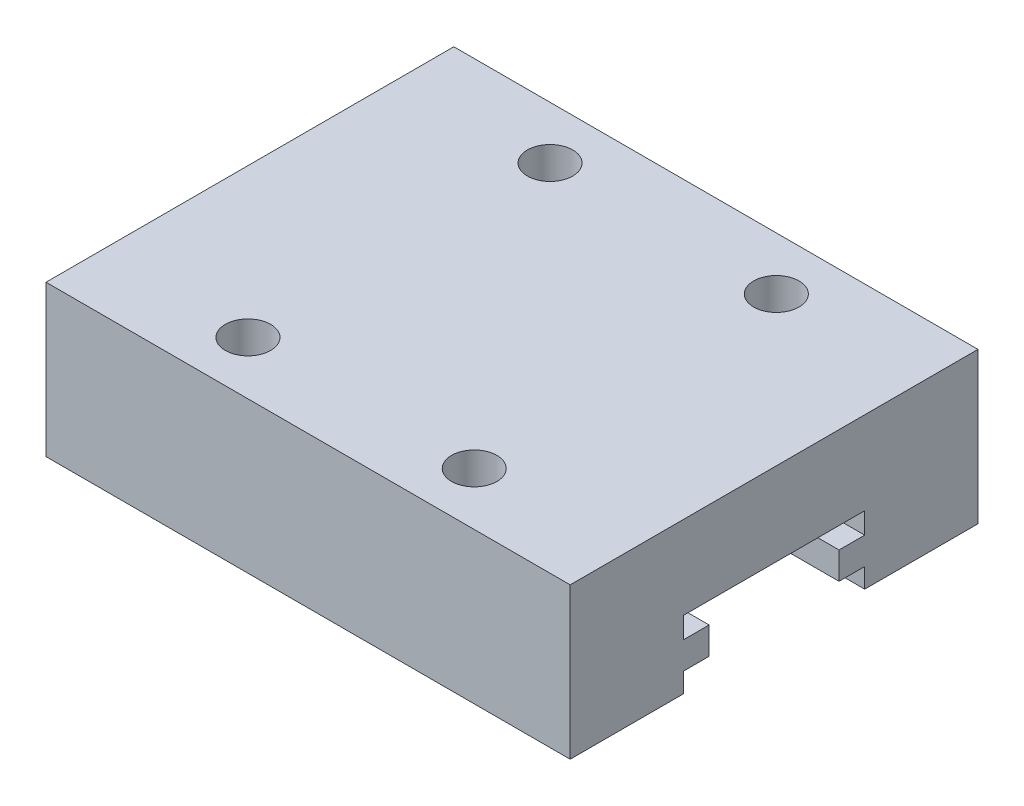
ISO-10303-21;
HEADER;
FILE_DESCRIPTION(('STEP AP214'),'2;1');
FILE_NAME('part.step','',(''),(''),'','','');
FILE_SCHEMA(('AUTOMOTIVE_DESIGN { 1 0 10303 214 1 1 1 1 }'));
ENDSEC;
DATA;
#1=APPLICATION_CONTEXT('core data for automotive mechanical design processes');
#2=APPLICATION_PROTOCOL_DEFINITION('international standard','automotive_design',2000,#1);
#3=PRODUCT_CONTEXT('',#1,'mechanical');
#4=PRODUCT('Part','Part','',(#3));
#5=PRODUCT_RELATED_PRODUCT_CATEGORY('part','',(#4));
#6=PRODUCT_DEFINITION_FORMATION('','',#4);
#7=PRODUCT_DEFINITION_CONTEXT('part definition',#1,'design');
#8=PRODUCT_DEFINITION('design','',#6,#7);
#9=PRODUCT_DEFINITION_SHAPE('','',#8);
#10=(LENGTH_UNIT() NAMED_UNIT(*) SI_UNIT(.MILLI.,.METRE.));
#11=(NAMED_UNIT(*) PLANE_ANGLE_UNIT() SI_UNIT($,.RADIAN.));
#12=(NAMED_UNIT(*) SI_UNIT($,.STERADIAN.) SOLID_ANGLE_UNIT());
#13=UNCERTAINTY_MEASURE_WITH_UNIT(LENGTH_MEASURE(1.E-05),#10,'distance_accuracy_value','');
#14=(GEOMETRIC_REPRESENTATION_CONTEXT(3) GLOBAL_UNCERTAINTY_ASSIGNED_CONTEXT((#13)) GLOBAL_UNIT_ASSIGNED_CONTEXT((#10,
#11,#12)) REPRESENTATION_CONTEXT('',''));
#15=CARTESIAN_POINT('',(0.,0.,0.));
#16=DIRECTION('',(0.,0.,1.));
#17=DIRECTION('',(1.,0.,0.));
#18=AXIS2_PLACEMENT_3D('',#15,#16,#17);
#19=CARTESIAN_POINT('',(0.,0.,0.));
#20=DIRECTION('',(0.,-1.,0.));
#21=DIRECTION('',(0.,0.,-1.));
#22=AXIS2_PLACEMENT_3D('',#19,#20,#21);
#23=PLANE('',#22);
#24=DIRECTION('',(1.,0.,0.));
#25=VECTOR('',#24,1.);
#26=CARTESIAN_POINT('',(-12.8160056179763,0.,-7.5));
#27=LINE('',#26,#25);
#28=CARTESIAN_POINT('',(0.,0.,-7.5));
#29=VERTEX_POINT('',#28);
#30=CARTESIAN_POINT('',(34.7,0.,-7.5));
#31=VERTEX_POINT('',#30);
#32=EDGE_CURVE('E162',#29,#31,#27,.T.);
#33=ORIENTED_EDGE('',*,*,#32,.T.);
#34=DIRECTION('',(0.,0.,-1.));
#35=VECTOR('',#34,1.);
#36=CARTESIAN_POINT('',(34.7,0.,0.));
#37=LINE('',#36,#35);
#38=CARTESIAN_POINT('',(34.7,0.,0.));
#39=VERTEX_POINT('',#38);
#40=EDGE_CURVE('E176',#39,#31,#37,.T.);
#41=ORIENTED_EDGE('',*,*,#40,.F.);
#42=DIRECTION('',(1.,0.,0.));
#43=VECTOR('',#42,1.);
#44=CARTESIAN_POINT('',(0.,0.,0.));
#45=LINE('',#44,#43);
#46=CARTESIAN_POINT('',(0.,0.,0.));
#47=VERTEX_POINT('',#46);
#48=EDGE_CURVE('E188',#47,#39,#45,.T.);
#49=ORIENTED_EDGE('',*,*,#48,.F.);
#50=DIRECTION('',(0.,0.,1.));
#51=VECTOR('',#50,1.);
#52=CARTESIAN_POINT('',(0.,0.,0.));
#53=LINE('',#52,#51);
#54=EDGE_CURVE('E177',#29,#47,#53,.T.);
#55=ORIENTED_EDGE('',*,*,#54,.F.);
#56=EDGE_LOOP('',(#33,#41,#49,#55));
#57=FACE_BOUND('',#56,.T.);
#58=ADVANCED_FACE('F37',(#57),#23,.T.);
#59=CARTESIAN_POINT('',(0.,10.,0.));
#60=DIRECTION('',(1.,0.,0.));
#61=DIRECTION('',(0.,0.,-1.));
#62=AXIS2_PLACEMENT_3D('',#59,#60,#61);
#63=PLANE('',#62);
#64=DIRECTION('',(0.,0.,-1.));
#65=VECTOR('',#64,1.);
#66=CARTESIAN_POINT('',(0.,1.3,-7.5));
#67=LINE('',#66,#65);
#68=CARTESIAN_POINT('',(0.,1.3,-7.5));
#69=VERTEX_POINT('',#68);
#70=CARTESIAN_POINT('',(0.,1.3,-9.2));
#71=VERTEX_POINT('',#70);
#72=EDGE_CURVE('E284',#69,#71,#67,.T.);
#73=ORIENTED_EDGE('',*,*,#72,.F.);
#74=DIRECTION('',(0.,1.,0.));
#75=VECTOR('',#74,1.);
#76=CARTESIAN_POINT('',(0.,0.,-7.5));
#77=LINE('',#76,#75);
#78=EDGE_CURVE('E233',#29,#69,#77,.T.);
#79=ORIENTED_EDGE('',*,*,#78,.F.);
#80=ORIENTED_EDGE('',*,*,#54,.T.);
#81=DIRECTION('',(0.,-1.,0.));
#82=VECTOR('',#81,1.);
#83=CARTESIAN_POINT('',(0.,10.,0.));
#84=LINE('',#83,#82);
#85=CARTESIAN_POINT('',(0.,10.,0.));
#86=VERTEX_POINT('',#85);
#87=EDGE_CURVE('E11',#86,#47,#84,.T.);
#88=ORIENTED_EDGE('',*,*,#87,.F.);
#89=DIRECTION('',(0.,0.,1.));
#90=VECTOR('',#89,1.);
#91=CARTESIAN_POINT('',(0.,10.,0.));
#92=LINE('',#91,#90);
#93=CARTESIAN_POINT('',(0.,10.,-27.));
#94=VERTEX_POINT('',#93);
#95=EDGE_CURVE('E186',#94,#86,#92,.T.);
#96=ORIENTED_EDGE('',*,*,#95,.F.);
#97=DIRECTION('',(0.,-1.,0.));
#98=VECTOR('',#97,1.);
#99=CARTESIAN_POINT('',(0.,10.,-27.));
#100=LINE('',#99,#98);
#101=CARTESIAN_POINT('',(0.,0.,-27.));
#102=VERTEX_POINT('',#101);
#103=EDGE_CURVE('E192',#94,#102,#100,.T.);
#104=ORIENTED_EDGE('',*,*,#103,.T.);
#105=CARTESIAN_POINT('',(0.,0.,-19.5));
#106=VERTEX_POINT('',#105);
#107=EDGE_CURVE('E202',#102,#106,#53,.T.);
#108=ORIENTED_EDGE('',*,*,#107,.T.);
#109=DIRECTION('',(0.,-1.,0.));
#110=VECTOR('',#109,1.);
#111=CARTESIAN_POINT('',(0.,0.,-19.5));
#112=LINE('',#111,#110);
#113=CARTESIAN_POINT('',(0.,1.3,-19.5));
#114=VERTEX_POINT('',#113);
#115=EDGE_CURVE('E52',#114,#106,#112,.T.);
#116=ORIENTED_EDGE('',*,*,#115,.F.);
#117=DIRECTION('',(0.,0.,-1.));
#118=VECTOR('',#117,1.);
#119=CARTESIAN_POINT('',(0.,1.3,-19.5));
#120=LINE('',#119,#118);
#121=CARTESIAN_POINT('',(0.,1.3,-17.8));
#122=VERTEX_POINT('',#121);
#123=EDGE_CURVE('E300',#122,#114,#120,.T.);
#124=ORIENTED_EDGE('',*,*,#123,.F.);
#125=DIRECTION('',(0.,-1.,0.));
#126=VECTOR('',#125,1.);
#127=CARTESIAN_POINT('',(0.,3.1,-17.8));
#128=LINE('',#127,#126);
#129=CARTESIAN_POINT('',(0.,3.1,-17.8));
#130=VERTEX_POINT('',#129);
#131=EDGE_CURVE('E298',#130,#122,#128,.T.);
#132=ORIENTED_EDGE('',*,*,#131,.F.);
#133=DIRECTION('',(0.,0.,1.));
#134=VECTOR('',#133,1.);
#135=CARTESIAN_POINT('',(0.,3.1,-19.5));
#136=LINE('',#135,#134);
#137=CARTESIAN_POINT('',(0.,3.1,-19.5));
#138=VERTEX_POINT('',#137);
#139=EDGE_CURVE('E296',#138,#130,#136,.T.);
#140=ORIENTED_EDGE('',*,*,#139,.F.);
#141=DIRECTION('',(0.,-1.,0.));
#142=VECTOR('',#141,1.);
#143=CARTESIAN_POINT('',(0.,3.1,-19.5));
#144=LINE('',#143,#142);
#145=CARTESIAN_POINT('',(0.,4.5,-19.5));
#146=VERTEX_POINT('',#145);
#147=EDGE_CURVE('E294',#146,#138,#144,.T.);
#148=ORIENTED_EDGE('',*,*,#147,.F.);
#149=DIRECTION('',(0.,0.,-1.));
#150=VECTOR('',#149,1.);
#151=CARTESIAN_POINT('',(0.,4.5,-7.5));
#152=LINE('',#151,#150);
#153=CARTESIAN_POINT('',(0.,4.5,-7.5));
#154=VERTEX_POINT('',#153);
#155=EDGE_CURVE('E292',#154,#146,#152,.T.);
#156=ORIENTED_EDGE('',*,*,#155,.F.);
#157=DIRECTION('',(0.,1.,0.));
#158=VECTOR('',#157,1.);
#159=CARTESIAN_POINT('',(0.,3.1,-7.5));
#160=LINE('',#159,#158);
#161=CARTESIAN_POINT('',(0.,3.1,-7.5));
#162=VERTEX_POINT('',#161);
#163=EDGE_CURVE('E290',#162,#154,#160,.T.);
#164=ORIENTED_EDGE('',*,*,#163,.F.);
#165=DIRECTION('',(0.,0.,1.));
#166=VECTOR('',#165,1.);
#167=CARTESIAN_POINT('',(0.,3.1,-7.5));
#168=LINE('',#167,#166);
#169=CARTESIAN_POINT('',(0.,3.1,-9.2));
#170=VERTEX_POINT('',#169);
#171=EDGE_CURVE('E288',#170,#162,#168,.T.);
#172=ORIENTED_EDGE('',*,*,#171,.F.);
#173=DIRECTION('',(0.,1.,0.));
#174=VECTOR('',#173,1.);
#175=CARTESIAN_POINT('',(0.,3.1,-9.2));
#176=LINE('',#175,#174);
#177=EDGE_CURVE('E286',#71,#170,#176,.T.);
#178=ORIENTED_EDGE('',*,*,#177,.F.);
#179=EDGE_LOOP('',(#73,#79,#80,#88,#96,#104,#108,#116,#124,#132,#140,#148,#156,#164,#172,#178));
#180=FACE_BOUND('',#179,.T.);
#181=ADVANCED_FACE('F39',(#180),#63,.F.);
#182=CARTESIAN_POINT('',(0.,10.,0.));
#183=DIRECTION('',(0.,0.,-1.));
#184=DIRECTION('',(-1.,0.,0.));
#185=AXIS2_PLACEMENT_3D('',#182,#183,#184);
#186=PLANE('',#185);
#187=ORIENTED_EDGE('',*,*,#48,.T.);
#188=DIRECTION('',(0.,-1.,0.));
#189=VECTOR('',#188,1.);
#190=CARTESIAN_POINT('',(34.7,10.,0.));
#191=LINE('',#190,#189);
#192=CARTESIAN_POINT('',(34.7,10.,0.));
#193=VERTEX_POINT('',#192);
#194=EDGE_CURVE('E45',#193,#39,#191,.T.);
#195=ORIENTED_EDGE('',*,*,#194,.F.);
#196=DIRECTION('',(1.,0.,0.));
#197=VECTOR('',#196,1.);
#198=CARTESIAN_POINT('',(0.,10.,0.));
#199=LINE('',#198,#197);
#200=EDGE_CURVE('E89',#86,#193,#199,.T.);
#201=ORIENTED_EDGE('',*,*,#200,.F.);
#202=ORIENTED_EDGE('',*,*,#87,.T.);
#203=EDGE_LOOP('',(#187,#195,#201,#202));
#204=FACE_BOUND('',#203,.T.);
#205=ADVANCED_FACE('F313',(#204),#186,.F.);
#206=CARTESIAN_POINT('',(34.7,10.,0.));
#207=DIRECTION('',(-1.,0.,0.));
#208=DIRECTION('',(0.,0.,1.));
#209=AXIS2_PLACEMENT_3D('',#206,#207,#208);
#210=PLANE('',#209);
#211=ORIENTED_EDGE('',*,*,#40,.T.);
#212=DIRECTION('',(0.,-1.,0.));
#213=VECTOR('',#212,1.);
#214=CARTESIAN_POINT('',(34.7,0.,-7.5));
#215=LINE('',#214,#213);
#216=CARTESIAN_POINT('',(34.7,1.3,-7.5));
#217=VERTEX_POINT('',#216);
#218=EDGE_CURVE('E159',#217,#31,#215,.T.);
#219=ORIENTED_EDGE('',*,*,#218,.F.);
#220=DIRECTION('',(0.,0.,1.));
#221=VECTOR('',#220,1.);
#222=CARTESIAN_POINT('',(34.7,1.3,-7.5));
#223=LINE('',#222,#221);
#224=CARTESIAN_POINT('',(34.7,1.3,-9.2));
#225=VERTEX_POINT('',#224);
#226=EDGE_CURVE('E179',#225,#217,#223,.T.);
#227=ORIENTED_EDGE('',*,*,#226,.F.);
#228=DIRECTION('',(0.,-1.,0.));
#229=VECTOR('',#228,1.);
#230=CARTESIAN_POINT('',(34.7,3.1,-9.2));
#231=LINE('',#230,#229);
#232=CARTESIAN_POINT('',(34.7,3.1,-9.2));
#233=VERTEX_POINT('',#232);
#234=EDGE_CURVE('E257',#233,#225,#231,.T.);
#235=ORIENTED_EDGE('',*,*,#234,.F.);
#236=DIRECTION('',(0.,0.,-1.));
#237=VECTOR('',#236,1.);
#238=CARTESIAN_POINT('',(34.7,3.1,-7.5));
#239=LINE('',#238,#237);
#240=CARTESIAN_POINT('',(34.7,3.1,-7.5));
#241=VERTEX_POINT('',#240);
#242=EDGE_CURVE('E260',#241,#233,#239,.T.);
#243=ORIENTED_EDGE('',*,*,#242,.F.);
#244=DIRECTION('',(0.,-1.,0.));
#245=VECTOR('',#244,1.);
#246=CARTESIAN_POINT('',(34.7,3.1,-7.5));
#247=LINE('',#246,#245);
#248=CARTESIAN_POINT('',(34.7,4.5,-7.5));
#249=VERTEX_POINT('',#248);
#250=EDGE_CURVE('E263',#249,#241,#247,.T.);
#251=ORIENTED_EDGE('',*,*,#250,.F.);
#252=DIRECTION('',(0.,0.,1.));
#253=VECTOR('',#252,1.);
#254=CARTESIAN_POINT('',(34.7,4.5,-7.5));
#255=LINE('',#254,#253);
#256=CARTESIAN_POINT('',(34.7,4.5,-19.5));
#257=VERTEX_POINT('',#256);
#258=EDGE_CURVE('E266',#257,#249,#255,.T.);
#259=ORIENTED_EDGE('',*,*,#258,.F.);
#260=DIRECTION('',(0.,1.,0.));
#261=VECTOR('',#260,1.);
#262=CARTESIAN_POINT('',(34.7,3.1,-19.5));
#263=LINE('',#262,#261);
#264=CARTESIAN_POINT('',(34.7,3.1,-19.5));
#265=VERTEX_POINT('',#264);
#266=EDGE_CURVE('E269',#265,#257,#263,.T.);
#267=ORIENTED_EDGE('',*,*,#266,.F.);
#268=DIRECTION('',(0.,0.,-1.));
#269=VECTOR('',#268,1.);
#270=CARTESIAN_POINT('',(34.7,3.1,-19.5));
#271=LINE('',#270,#269);
#272=CARTESIAN_POINT('',(34.7,3.1,-17.8));
#273=VERTEX_POINT('',#272);
#274=EDGE_CURVE('E272',#273,#265,#271,.T.);
#275=ORIENTED_EDGE('',*,*,#274,.F.);
#276=DIRECTION('',(0.,1.,0.));
#277=VECTOR('',#276,1.);
#278=CARTESIAN_POINT('',(34.7,3.1,-17.8));
#279=LINE('',#278,#277);
#280=CARTESIAN_POINT('',(34.7,1.3,-17.8));
#281=VERTEX_POINT('',#280);
#282=EDGE_CURVE('E275',#281,#273,#279,.T.);
#283=ORIENTED_EDGE('',*,*,#282,.F.);
#284=DIRECTION('',(0.,0.,1.));
#285=VECTOR('',#284,1.);
#286=CARTESIAN_POINT('',(34.7,1.3,-19.5));
#287=LINE('',#286,#285);
#288=CARTESIAN_POINT('',(34.7,1.3,-19.5));
#289=VERTEX_POINT('',#288);
#290=EDGE_CURVE('E278',#289,#281,#287,.T.);
#291=ORIENTED_EDGE('',*,*,#290,.F.);
#292=DIRECTION('',(0.,1.,0.));
#293=VECTOR('',#292,1.);
#294=CARTESIAN_POINT('',(34.7,0.,-19.5));
#295=LINE('',#294,#293);
#296=CARTESIAN_POINT('',(34.7,0.,-19.5));
#297=VERTEX_POINT('',#296);
#298=EDGE_CURVE('E170',#297,#289,#295,.T.);
#299=ORIENTED_EDGE('',*,*,#298,.F.);
#300=CARTESIAN_POINT('',(34.7,0.,-27.));
#301=VERTEX_POINT('',#300);
#302=EDGE_CURVE('E184',#297,#301,#37,.T.);
#303=ORIENTED_EDGE('',*,*,#302,.T.);
#304=DIRECTION('',(0.,-1.,0.));
#305=VECTOR('',#304,1.);
#306=CARTESIAN_POINT('',(34.7,10.,-27.));
#307=LINE('',#306,#305);
#308=CARTESIAN_POINT('',(34.7,10.,-27.));
#309=VERTEX_POINT('',#308);
#310=EDGE_CURVE('E194',#309,#301,#307,.T.);
#311=ORIENTED_EDGE('',*,*,#310,.F.);
#312=DIRECTION('',(0.,0.,-1.));
#313=VECTOR('',#312,1.);
#314=CARTESIAN_POINT('',(34.7,10.,0.));
#315=LINE('',#314,#313);
#316=EDGE_CURVE('E208',#193,#309,#315,.T.);
#317=ORIENTED_EDGE('',*,*,#316,.F.);
#318=ORIENTED_EDGE('',*,*,#194,.T.);
#319=EDGE_LOOP('',(#211,#219,#227,#235,#243,#251,#259,#267,#275,#283,#291,#299,#303,#311,#317,#318));
#320=FACE_BOUND('',#319,.T.);
#321=ADVANCED_FACE('F182',(#320),#210,.F.);
#322=CARTESIAN_POINT('',(0.,10.,-27.));
#323=DIRECTION('',(0.,0.,1.));
#324=DIRECTION('',(1.,0.,0.));
#325=AXIS2_PLACEMENT_3D('',#322,#323,#324);
#326=PLANE('',#325);
#327=DIRECTION('',(-1.,0.,0.));
#328=VECTOR('',#327,1.);
#329=CARTESIAN_POINT('',(0.,0.,-27.));
#330=LINE('',#329,#328);
#331=EDGE_CURVE('E82',#301,#102,#330,.T.);
#332=ORIENTED_EDGE('',*,*,#331,.T.);
#333=ORIENTED_EDGE('',*,*,#103,.F.);
#334=DIRECTION('',(-1.,0.,0.));
#335=VECTOR('',#334,1.);
#336=CARTESIAN_POINT('',(0.,10.,-27.));
#337=LINE('',#336,#335);
#338=EDGE_CURVE('E61',#309,#94,#337,.T.);
#339=ORIENTED_EDGE('',*,*,#338,.F.);
#340=ORIENTED_EDGE('',*,*,#310,.T.);
#341=EDGE_LOOP('',(#332,#333,#339,#340));
#342=FACE_BOUND('',#341,.T.);
#343=ADVANCED_FACE('F196',(#342),#326,.F.);
#344=CARTESIAN_POINT('',(0.,10.,0.));
#345=DIRECTION('',(0.,-1.,0.));
#346=DIRECTION('',(0.,0.,-1.));
#347=AXIS2_PLACEMENT_3D('',#344,#345,#346);
#348=PLANE('',#347);
#349=CARTESIAN_POINT('',(24.8499864669187,10.,-23.5));
#350=DIRECTION('',(0.,1.,0.));
#351=DIRECTION('',(0.,0.,1.));
#352=AXIS2_PLACEMENT_3D('',#349,#350,#351);
#353=CIRCLE('',#352,1.5);
#354=CARTESIAN_POINT('',(24.8499864669187,10.,-22.));
#355=VERTEX_POINT('',#354);
#356=EDGE_CURVE('E225',#355,#355,#353,.T.);
#357=ORIENTED_EDGE('',*,*,#356,.F.);
#358=EDGE_LOOP('',(#357));
#359=FACE_BOUND('',#358,.T.);
#360=CARTESIAN_POINT('',(9.85,10.,-3.52014924954561));
#361=DIRECTION('',(0.,1.,0.));
#362=DIRECTION('',(0.,0.,1.));
#363=AXIS2_PLACEMENT_3D('',#360,#361,#362);
#364=CIRCLE('',#363,1.5);
#365=CARTESIAN_POINT('',(9.85,10.,-2.02014924954561));
#366=VERTEX_POINT('',#365);
#367=EDGE_CURVE('E218',#366,#366,#364,.T.);
#368=ORIENTED_EDGE('',*,*,#367,.F.);
#369=EDGE_LOOP('',(#368));
#370=FACE_BOUND('',#369,.T.);
#371=CARTESIAN_POINT('',(24.8499864669187,10.,-3.5));
#372=DIRECTION('',(0.,1.,0.));
#373=DIRECTION('',(0.,0.,1.));
#374=AXIS2_PLACEMENT_3D('',#371,#372,#373);
#375=CIRCLE('',#374,1.5);
#376=CARTESIAN_POINT('',(24.8499864669187,10.,-2.));
#377=VERTEX_POINT('',#376);
#378=EDGE_CURVE('E230',#377,#377,#375,.T.);
#379=ORIENTED_EDGE('',*,*,#378,.F.);
#380=EDGE_LOOP('',(#379));
#381=FACE_BOUND('',#380,.T.);
#382=CARTESIAN_POINT('',(9.85,10.,-23.5201492495456));
#383=DIRECTION('',(0.,1.,0.));
#384=DIRECTION('',(0.,0.,1.));
#385=AXIS2_PLACEMENT_3D('',#382,#383,#384);
#386=CIRCLE('',#385,1.5);
#387=CARTESIAN_POINT('',(9.85,10.,-22.0201492495456));
#388=VERTEX_POINT('',#387);
#389=EDGE_CURVE('E212',#388,#388,#386,.T.);
#390=ORIENTED_EDGE('',*,*,#389,.F.);
#391=EDGE_LOOP('',(#390));
#392=FACE_BOUND('',#391,.T.);
#393=ORIENTED_EDGE('',*,*,#95,.T.);
#394=ORIENTED_EDGE('',*,*,#200,.T.);
#395=ORIENTED_EDGE('',*,*,#316,.T.);
#396=ORIENTED_EDGE('',*,*,#338,.T.);
#397=EDGE_LOOP('',(#393,#394,#395,#396));
#398=FACE_BOUND('',#397,.T.);
#399=ADVANCED_FACE('F325',(#359,#370,#381,#392,#398),#348,.F.);
#400=DIRECTION('',(1.,0.,0.));
#401=VECTOR('',#400,1.);
#402=CARTESIAN_POINT('',(-12.8160056179763,0.,-19.5));
#403=LINE('',#402,#401);
#404=EDGE_CURVE('E178',#106,#297,#403,.T.);
#405=ORIENTED_EDGE('',*,*,#404,.F.);
#406=ORIENTED_EDGE('',*,*,#107,.F.);
#407=ORIENTED_EDGE('',*,*,#331,.F.);
#408=ORIENTED_EDGE('',*,*,#302,.F.);
#409=EDGE_LOOP('',(#405,#406,#407,#408));
#410=FACE_BOUND('',#409,.T.);
#411=ADVANCED_FACE('F200',(#410),#23,.T.);
#412=CARTESIAN_POINT('',(9.85,5.,-23.5201492495456));
#413=DIRECTION('',(0.,1.,0.));
#414=DIRECTION('',(0.,0.,1.));
#415=AXIS2_PLACEMENT_3D('',#412,#413,#414);
#416=CYLINDRICAL_SURFACE('',#415,1.5);
#417=CARTESIAN_POINT('',(9.85,5.,-23.5201492495456));
#418=DIRECTION('',(0.,1.,0.));
#419=DIRECTION('',(0.,0.,1.));
#420=AXIS2_PLACEMENT_3D('',#417,#418,#419);
#421=CIRCLE('',#420,1.5);
#422=CARTESIAN_POINT('',(9.85,5.,-22.0201492495456));
#423=VERTEX_POINT('',#422);
#424=EDGE_CURVE('E204',#423,#423,#421,.T.);
#425=ORIENTED_EDGE('',*,*,#424,.F.);
#426=EDGE_LOOP('',(#425));
#427=FACE_BOUND('',#426,.T.);
#428=ORIENTED_EDGE('',*,*,#389,.T.);
#429=EDGE_LOOP('',(#428));
#430=FACE_BOUND('',#429,.T.);
#431=ADVANCED_FACE('F324',(#427,#430),#416,.F.);
#432=CARTESIAN_POINT('',(9.85,5.,-23.5201492495456));
#433=DIRECTION('',(0.,1.,0.));
#434=DIRECTION('',(0.,0.,1.));
#435=AXIS2_PLACEMENT_3D('',#432,#433,#434);
#436=PLANE('',#435);
#437=ORIENTED_EDGE('',*,*,#424,.T.);
#438=EDGE_LOOP('',(#437));
#439=FACE_BOUND('',#438,.T.);
#440=ADVANCED_FACE('F330',(#439),#436,.T.);
#441=CARTESIAN_POINT('',(24.8499864669187,5.,-3.5));
#442=DIRECTION('',(0.,1.,0.));
#443=DIRECTION('',(0.,0.,1.));
#444=AXIS2_PLACEMENT_3D('',#441,#442,#443);
#445=CYLINDRICAL_SURFACE('',#444,1.5);
#446=CARTESIAN_POINT('',(24.8499864669187,5.,-3.5));
#447=DIRECTION('',(0.,1.,0.));
#448=DIRECTION('',(0.,0.,1.));
#449=AXIS2_PLACEMENT_3D('',#446,#447,#448);
#450=CIRCLE('',#449,1.5);
#451=CARTESIAN_POINT('',(24.8499864669187,5.,-2.));
#452=VERTEX_POINT('',#451);
#453=EDGE_CURVE('E222',#452,#452,#450,.T.);
#454=ORIENTED_EDGE('',*,*,#453,.F.);
#455=EDGE_LOOP('',(#454));
#456=FACE_BOUND('',#455,.T.);
#457=ORIENTED_EDGE('',*,*,#378,.T.);
#458=EDGE_LOOP('',(#457));
#459=FACE_BOUND('',#458,.T.);
#460=ADVANCED_FACE('F342',(#456,#459),#445,.F.);
#461=CARTESIAN_POINT('',(24.8499864669187,5.,-3.5));
#462=DIRECTION('',(0.,1.,0.));
#463=DIRECTION('',(0.,0.,1.));
#464=AXIS2_PLACEMENT_3D('',#461,#462,#463);
#465=PLANE('',#464);
#466=ORIENTED_EDGE('',*,*,#453,.T.);
#467=EDGE_LOOP('',(#466));
#468=FACE_BOUND('',#467,.T.);
#469=ADVANCED_FACE('F348',(#468),#465,.T.);
#470=CARTESIAN_POINT('',(9.85,5.,-3.52014924954561));
#471=DIRECTION('',(0.,1.,0.));
#472=DIRECTION('',(0.,0.,1.));
#473=AXIS2_PLACEMENT_3D('',#470,#471,#472);
#474=CYLINDRICAL_SURFACE('',#473,1.5);
#475=CARTESIAN_POINT('',(9.85,5.,-3.52014924954561));
#476=DIRECTION('',(0.,1.,0.));
#477=DIRECTION('',(0.,0.,1.));
#478=AXIS2_PLACEMENT_3D('',#475,#476,#477);
#479=CIRCLE('',#478,1.5);
#480=CARTESIAN_POINT('',(9.85,5.,-2.02014924954561));
#481=VERTEX_POINT('',#480);
#482=EDGE_CURVE('E221',#481,#481,#479,.T.);
#483=ORIENTED_EDGE('',*,*,#482,.F.);
#484=EDGE_LOOP('',(#483));
#485=FACE_BOUND('',#484,.T.);
#486=ORIENTED_EDGE('',*,*,#367,.T.);
#487=EDGE_LOOP('',(#486));
#488=FACE_BOUND('',#487,.T.);
#489=ADVANCED_FACE('F344',(#485,#488),#474,.F.);
#490=CARTESIAN_POINT('',(9.85,5.,-3.52014924954561));
#491=DIRECTION('',(0.,1.,0.));
#492=DIRECTION('',(0.,0.,1.));
#493=AXIS2_PLACEMENT_3D('',#490,#491,#492);
#494=PLANE('',#493);
#495=ORIENTED_EDGE('',*,*,#482,.T.);
#496=EDGE_LOOP('',(#495));
#497=FACE_BOUND('',#496,.T.);
#498=ADVANCED_FACE('F347',(#497),#494,.T.);
#499=CARTESIAN_POINT('',(24.8499864669187,5.,-23.5));
#500=DIRECTION('',(0.,1.,0.));
#501=DIRECTION('',(0.,0.,1.));
#502=AXIS2_PLACEMENT_3D('',#499,#500,#501);
#503=CYLINDRICAL_SURFACE('',#502,1.5);
#504=CARTESIAN_POINT('',(24.8499864669187,5.,-23.5));
#505=DIRECTION('',(0.,1.,0.));
#506=DIRECTION('',(0.,0.,1.));
#507=AXIS2_PLACEMENT_3D('',#504,#505,#506);
#508=CIRCLE('',#507,1.5);
#509=CARTESIAN_POINT('',(24.8499864669187,5.,-22.));
#510=VERTEX_POINT('',#509);
#511=EDGE_CURVE('E215',#510,#510,#508,.T.);
#512=ORIENTED_EDGE('',*,*,#511,.F.);
#513=EDGE_LOOP('',(#512));
#514=FACE_BOUND('',#513,.T.);
#515=ORIENTED_EDGE('',*,*,#356,.T.);
#516=EDGE_LOOP('',(#515));
#517=FACE_BOUND('',#516,.T.);
#518=ADVANCED_FACE('F352',(#514,#517),#503,.F.);
#519=CARTESIAN_POINT('',(24.8499864669187,5.,-23.5));
#520=DIRECTION('',(0.,1.,0.));
#521=DIRECTION('',(0.,0.,1.));
#522=AXIS2_PLACEMENT_3D('',#519,#520,#521);
#523=PLANE('',#522);
#524=ORIENTED_EDGE('',*,*,#511,.T.);
#525=EDGE_LOOP('',(#524));
#526=FACE_BOUND('',#525,.T.);
#527=ADVANCED_FACE('F356',(#526),#523,.T.);
#528=CARTESIAN_POINT('',(-12.8160056179763,0.,-7.5));
#529=DIRECTION('',(0.,0.,1.));
#530=DIRECTION('',(0.,-1.,0.));
#531=AXIS2_PLACEMENT_3D('',#528,#529,#530);
#532=PLANE('',#531);
#533=ORIENTED_EDGE('',*,*,#78,.T.);
#534=DIRECTION('',(1.,0.,0.));
#535=VECTOR('',#534,1.);
#536=CARTESIAN_POINT('',(-12.8160056179763,1.3,-7.5));
#537=LINE('',#536,#535);
#538=EDGE_CURVE('E165',#69,#217,#537,.T.);
#539=ORIENTED_EDGE('',*,*,#538,.T.);
#540=ORIENTED_EDGE('',*,*,#218,.T.);
#541=ORIENTED_EDGE('',*,*,#32,.F.);
#542=EDGE_LOOP('',(#533,#539,#540,#541));
#543=FACE_BOUND('',#542,.T.);
#544=ADVANCED_FACE('F161',(#543),#532,.F.);
#545=CARTESIAN_POINT('',(-12.8160056179763,1.3,-7.5));
#546=DIRECTION('',(0.,1.,0.));
#547=DIRECTION('',(0.,0.,1.));
#548=AXIS2_PLACEMENT_3D('',#545,#546,#547);
#549=PLANE('',#548);
#550=ORIENTED_EDGE('',*,*,#72,.T.);
#551=DIRECTION('',(1.,0.,0.));
#552=VECTOR('',#551,1.);
#553=CARTESIAN_POINT('',(-12.8160056179763,1.3,-9.2));
#554=LINE('',#553,#552);
#555=EDGE_CURVE('E253',#71,#225,#554,.T.);
#556=ORIENTED_EDGE('',*,*,#555,.T.);
#557=ORIENTED_EDGE('',*,*,#226,.T.);
#558=ORIENTED_EDGE('',*,*,#538,.F.);
#559=EDGE_LOOP('',(#550,#556,#557,#558));
#560=FACE_BOUND('',#559,.T.);
#561=ADVANCED_FACE('F369',(#560),#549,.F.);
#562=CARTESIAN_POINT('',(-12.8160056179763,3.1,-9.2));
#563=DIRECTION('',(0.,0.,1.));
#564=DIRECTION('',(0.,-1.,0.));
#565=AXIS2_PLACEMENT_3D('',#562,#563,#564);
#566=PLANE('',#565);
#567=ORIENTED_EDGE('',*,*,#177,.T.);
#568=DIRECTION('',(1.,0.,0.));
#569=VECTOR('',#568,1.);
#570=CARTESIAN_POINT('',(-12.8160056179763,3.1,-9.2));
#571=LINE('',#570,#569);
#572=EDGE_CURVE('E251',#170,#233,#571,.T.);
#573=ORIENTED_EDGE('',*,*,#572,.T.);
#574=ORIENTED_EDGE('',*,*,#234,.T.);
#575=ORIENTED_EDGE('',*,*,#555,.F.);
#576=EDGE_LOOP('',(#567,#573,#574,#575));
#577=FACE_BOUND('',#576,.T.);
#578=ADVANCED_FACE('F397',(#577),#566,.F.);
#579=CARTESIAN_POINT('',(-12.8160056179763,3.1,-7.5));
#580=DIRECTION('',(0.,-1.,0.));
#581=DIRECTION('',(0.,0.,-1.));
#582=AXIS2_PLACEMENT_3D('',#579,#580,#581);
#583=PLANE('',#582);
#584=ORIENTED_EDGE('',*,*,#171,.T.);
#585=DIRECTION('',(1.,0.,0.));
#586=VECTOR('',#585,1.);
#587=CARTESIAN_POINT('',(-12.8160056179763,3.1,-7.5));
#588=LINE('',#587,#586);
#589=EDGE_CURVE('E249',#162,#241,#588,.T.);
#590=ORIENTED_EDGE('',*,*,#589,.T.);
#591=ORIENTED_EDGE('',*,*,#242,.T.);
#592=ORIENTED_EDGE('',*,*,#572,.F.);
#593=EDGE_LOOP('',(#584,#590,#591,#592));
#594=FACE_BOUND('',#593,.T.);
#595=ADVANCED_FACE('F393',(#594),#583,.F.);
#596=CARTESIAN_POINT('',(-12.8160056179763,3.1,-7.5));
#597=DIRECTION('',(0.,0.,1.));
#598=DIRECTION('',(0.,-1.,0.));
#599=AXIS2_PLACEMENT_3D('',#596,#597,#598);
#600=PLANE('',#599);
#601=ORIENTED_EDGE('',*,*,#163,.T.);
#602=DIRECTION('',(1.,0.,0.));
#603=VECTOR('',#602,1.);
#604=CARTESIAN_POINT('',(-12.8160056179763,4.5,-7.5));
#605=LINE('',#604,#603);
#606=EDGE_CURVE('E247',#154,#249,#605,.T.);
#607=ORIENTED_EDGE('',*,*,#606,.T.);
#608=ORIENTED_EDGE('',*,*,#250,.T.);
#609=ORIENTED_EDGE('',*,*,#589,.F.);
#610=EDGE_LOOP('',(#601,#607,#608,#609));
#611=FACE_BOUND('',#610,.T.);
#612=ADVANCED_FACE('F389',(#611),#600,.F.);
#613=CARTESIAN_POINT('',(-12.8160056179763,4.5,-7.5));
#614=DIRECTION('',(0.,1.,0.));
#615=DIRECTION('',(0.,0.,1.));
#616=AXIS2_PLACEMENT_3D('',#613,#614,#615);
#617=PLANE('',#616);
#618=ORIENTED_EDGE('',*,*,#155,.T.);
#619=DIRECTION('',(1.,0.,0.));
#620=VECTOR('',#619,1.);
#621=CARTESIAN_POINT('',(-12.8160056179763,4.5,-19.5));
#622=LINE('',#621,#620);
#623=EDGE_CURVE('E245',#146,#257,#622,.T.);
#624=ORIENTED_EDGE('',*,*,#623,.T.);
#625=ORIENTED_EDGE('',*,*,#258,.T.);
#626=ORIENTED_EDGE('',*,*,#606,.F.);
#627=EDGE_LOOP('',(#618,#624,#625,#626));
#628=FACE_BOUND('',#627,.T.);
#629=ADVANCED_FACE('F385',(#628),#617,.F.);
#630=CARTESIAN_POINT('',(-12.8160056179763,3.1,-19.5));
#631=DIRECTION('',(0.,0.,-1.));
#632=DIRECTION('',(0.,1.,0.));
#633=AXIS2_PLACEMENT_3D('',#630,#631,#632);
#634=PLANE('',#633);
#635=ORIENTED_EDGE('',*,*,#147,.T.);
#636=DIRECTION('',(1.,0.,0.));
#637=VECTOR('',#636,1.);
#638=CARTESIAN_POINT('',(-12.8160056179763,3.1,-19.5));
#639=LINE('',#638,#637);
#640=EDGE_CURVE('E243',#138,#265,#639,.T.);
#641=ORIENTED_EDGE('',*,*,#640,.T.);
#642=ORIENTED_EDGE('',*,*,#266,.T.);
#643=ORIENTED_EDGE('',*,*,#623,.F.);
#644=EDGE_LOOP('',(#635,#641,#642,#643));
#645=FACE_BOUND('',#644,.T.);
#646=ADVANCED_FACE('F381',(#645),#634,.F.);
#647=CARTESIAN_POINT('',(-12.8160056179763,3.1,-19.5));
#648=DIRECTION('',(0.,-1.,0.));
#649=DIRECTION('',(0.,0.,-1.));
#650=AXIS2_PLACEMENT_3D('',#647,#648,#649);
#651=PLANE('',#650);
#652=ORIENTED_EDGE('',*,*,#139,.T.);
#653=DIRECTION('',(1.,0.,0.));
#654=VECTOR('',#653,1.);
#655=CARTESIAN_POINT('',(-12.8160056179763,3.1,-17.8));
#656=LINE('',#655,#654);
#657=EDGE_CURVE('E241',#130,#273,#656,.T.);
#658=ORIENTED_EDGE('',*,*,#657,.T.);
#659=ORIENTED_EDGE('',*,*,#274,.T.);
#660=ORIENTED_EDGE('',*,*,#640,.F.);
#661=EDGE_LOOP('',(#652,#658,#659,#660));
#662=FACE_BOUND('',#661,.T.);
#663=ADVANCED_FACE('F377',(#662),#651,.F.);
#664=CARTESIAN_POINT('',(-12.8160056179763,3.1,-17.8));
#665=DIRECTION('',(0.,0.,-1.));
#666=DIRECTION('',(0.,1.,0.));
#667=AXIS2_PLACEMENT_3D('',#664,#665,#666);
#668=PLANE('',#667);
#669=ORIENTED_EDGE('',*,*,#131,.T.);
#670=DIRECTION('',(1.,0.,0.));
#671=VECTOR('',#670,1.);
#672=CARTESIAN_POINT('',(-12.8160056179763,1.3,-17.8));
#673=LINE('',#672,#671);
#674=EDGE_CURVE('E239',#122,#281,#673,.T.);
#675=ORIENTED_EDGE('',*,*,#674,.T.);
#676=ORIENTED_EDGE('',*,*,#282,.T.);
#677=ORIENTED_EDGE('',*,*,#657,.F.);
#678=EDGE_LOOP('',(#669,#675,#676,#677));
#679=FACE_BOUND('',#678,.T.);
#680=ADVANCED_FACE('F374',(#679),#668,.F.);
#681=CARTESIAN_POINT('',(-12.8160056179763,1.3,-19.5));
#682=DIRECTION('',(0.,1.,0.));
#683=DIRECTION('',(0.,0.,1.));
#684=AXIS2_PLACEMENT_3D('',#681,#682,#683);
#685=PLANE('',#684);
#686=ORIENTED_EDGE('',*,*,#123,.T.);
#687=DIRECTION('',(1.,0.,0.));
#688=VECTOR('',#687,1.);
#689=CARTESIAN_POINT('',(-12.8160056179763,1.3,-19.5));
#690=LINE('',#689,#688);
#691=EDGE_CURVE('E237',#114,#289,#690,.T.);
#692=ORIENTED_EDGE('',*,*,#691,.T.);
#693=ORIENTED_EDGE('',*,*,#290,.T.);
#694=ORIENTED_EDGE('',*,*,#674,.F.);
#695=EDGE_LOOP('',(#686,#692,#693,#694));
#696=FACE_BOUND('',#695,.T.);
#697=ADVANCED_FACE('F305',(#696),#685,.F.);
#698=CARTESIAN_POINT('',(-12.8160056179763,0.,-19.5));
#699=DIRECTION('',(0.,0.,-1.));
#700=DIRECTION('',(0.,1.,0.));
#701=AXIS2_PLACEMENT_3D('',#698,#699,#700);
#702=PLANE('',#701);
#703=ORIENTED_EDGE('',*,*,#115,.T.);
#704=ORIENTED_EDGE('',*,*,#404,.T.);
#705=ORIENTED_EDGE('',*,*,#298,.T.);
#706=ORIENTED_EDGE('',*,*,#691,.F.);
#707=EDGE_LOOP('',(#703,#704,#705,#706));
#708=FACE_BOUND('',#707,.T.);
#709=ADVANCED_FACE('F307',(#708),#702,.F.);
#710=CLOSED_SHELL('',(#58,#181,#205,#321,#343,#399,#411,#431,#440,#460,#469,#489,#498,#518,#527,
#544,#561,#578,#595,#612,#629,#646,#663,#680,#697,#709));
#711=MANIFOLD_SOLID_BREP('B2',#710);
#712=ADVANCED_BREP_SHAPE_REPRESENTATION('',(#18,#711),#14);
#713=SHAPE_DEFINITION_REPRESENTATION(#9,#712);
ENDSEC;
END-ISO-10303-21;
